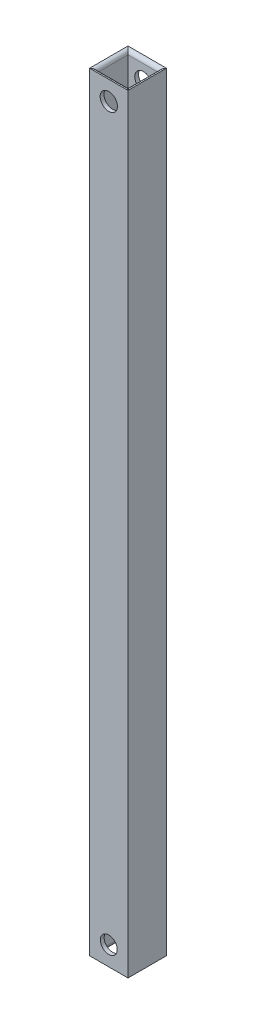
ISO-10303-21;
HEADER;
FILE_DESCRIPTION(('STEP AP214'),'2;1');
FILE_NAME('part.step','',(''),(''),'','','');
FILE_SCHEMA(('AUTOMOTIVE_DESIGN { 1 0 10303 214 1 1 1 1 }'));
ENDSEC;
DATA;
#1=APPLICATION_CONTEXT('core data for automotive mechanical design processes');
#2=APPLICATION_PROTOCOL_DEFINITION('international standard','automotive_design',2000,#1);
#3=PRODUCT_CONTEXT('',#1,'mechanical');
#4=PRODUCT('Part','Part','',(#3));
#5=PRODUCT_RELATED_PRODUCT_CATEGORY('part','',(#4));
#6=PRODUCT_DEFINITION_FORMATION('','',#4);
#7=PRODUCT_DEFINITION_CONTEXT('part definition',#1,'design');
#8=PRODUCT_DEFINITION('design','',#6,#7);
#9=PRODUCT_DEFINITION_SHAPE('','',#8);
#10=(LENGTH_UNIT() NAMED_UNIT(*) SI_UNIT(.MILLI.,.METRE.));
#11=(NAMED_UNIT(*) PLANE_ANGLE_UNIT() SI_UNIT($,.RADIAN.));
#12=(NAMED_UNIT(*) SI_UNIT($,.STERADIAN.) SOLID_ANGLE_UNIT());
#13=UNCERTAINTY_MEASURE_WITH_UNIT(LENGTH_MEASURE(1.E-05),#10,'distance_accuracy_value','');
#14=(GEOMETRIC_REPRESENTATION_CONTEXT(3) GLOBAL_UNCERTAINTY_ASSIGNED_CONTEXT((#13)) GLOBAL_UNIT_ASSIGNED_CONTEXT((#10,
#11,#12)) REPRESENTATION_CONTEXT('',''));
#15=CARTESIAN_POINT('',(0.,0.,0.));
#16=DIRECTION('',(0.,0.,1.));
#17=DIRECTION('',(1.,0.,0.));
#18=AXIS2_PLACEMENT_3D('',#15,#16,#17);
#19=CARTESIAN_POINT('',(5.,200.,-5.));
#20=DIRECTION('',(-1.,0.,0.));
#21=DIRECTION('',(0.,0.,1.));
#22=AXIS2_PLACEMENT_3D('',#19,#20,#21);
#23=PLANE('',#22);
#24=DIRECTION('',(0.,0.,-1.));
#25=VECTOR('',#24,1.);
#26=CARTESIAN_POINT('',(5.,0.,-5.));
#27=LINE('',#26,#25);
#28=CARTESIAN_POINT('',(5.,0.,5.));
#29=VERTEX_POINT('',#28);
#30=CARTESIAN_POINT('',(5.,0.,-5.));
#31=VERTEX_POINT('',#30);
#32=EDGE_CURVE('E141',#29,#31,#27,.T.);
#33=ORIENTED_EDGE('',*,*,#32,.T.);
#34=DIRECTION('',(0.,-1.,0.));
#35=VECTOR('',#34,1.);
#36=CARTESIAN_POINT('',(5.,200.,-5.));
#37=LINE('',#36,#35);
#38=CARTESIAN_POINT('',(5.,200.,-5.));
#39=VERTEX_POINT('',#38);
#40=EDGE_CURVE('E126',#39,#31,#37,.T.);
#41=ORIENTED_EDGE('',*,*,#40,.F.);
#42=DIRECTION('',(0.,0.,-1.));
#43=VECTOR('',#42,1.);
#44=CARTESIAN_POINT('',(5.,200.,-5.));
#45=LINE('',#44,#43);
#46=CARTESIAN_POINT('',(5.,200.,5.));
#47=VERTEX_POINT('',#46);
#48=EDGE_CURVE('E135',#47,#39,#45,.T.);
#49=ORIENTED_EDGE('',*,*,#48,.F.);
#50=DIRECTION('',(0.,-1.,0.));
#51=VECTOR('',#50,1.);
#52=CARTESIAN_POINT('',(5.,200.,5.));
#53=LINE('',#52,#51);
#54=EDGE_CURVE('E225',#47,#29,#53,.T.);
#55=ORIENTED_EDGE('',*,*,#54,.T.);
#56=EDGE_LOOP('',(#33,#41,#49,#55));
#57=FACE_BOUND('',#56,.T.);
#58=ADVANCED_FACE('F54',(#57),#23,.F.);
#59=CARTESIAN_POINT('',(-5.,200.,-5.));
#60=DIRECTION('',(0.,0.,1.));
#61=DIRECTION('',(1.,0.,0.));
#62=AXIS2_PLACEMENT_3D('',#59,#60,#61);
#63=PLANE('',#62);
#64=CARTESIAN_POINT('',(0.,5.,-5.));
#65=DIRECTION('',(0.,0.,1.));
#66=DIRECTION('',(1.,0.,0.));
#67=AXIS2_PLACEMENT_3D('',#64,#65,#66);
#68=CIRCLE('',#67,2.2);
#69=CARTESIAN_POINT('',(2.2,5.,-5.));
#70=VERTEX_POINT('',#69);
#71=EDGE_CURVE('E179',#70,#70,#68,.T.);
#72=ORIENTED_EDGE('',*,*,#71,.T.);
#73=EDGE_LOOP('',(#72));
#74=FACE_BOUND('',#73,.T.);
#75=CARTESIAN_POINT('',(0.,195.,-5.));
#76=DIRECTION('',(0.,0.,1.));
#77=DIRECTION('',(1.,0.,0.));
#78=AXIS2_PLACEMENT_3D('',#75,#76,#77);
#79=CIRCLE('',#78,2.25);
#80=CARTESIAN_POINT('',(2.25,195.,-5.));
#81=VERTEX_POINT('',#80);
#82=EDGE_CURVE('E201',#81,#81,#79,.T.);
#83=ORIENTED_EDGE('',*,*,#82,.T.);
#84=EDGE_LOOP('',(#83));
#85=FACE_BOUND('',#84,.T.);
#86=DIRECTION('',(-1.,0.,0.));
#87=VECTOR('',#86,1.);
#88=CARTESIAN_POINT('',(-5.,0.,-5.));
#89=LINE('',#88,#87);
#90=CARTESIAN_POINT('',(-5.,0.,-5.));
#91=VERTEX_POINT('',#90);
#92=EDGE_CURVE('E228',#31,#91,#89,.T.);
#93=ORIENTED_EDGE('',*,*,#92,.T.);
#94=DIRECTION('',(0.,-1.,0.));
#95=VECTOR('',#94,1.);
#96=CARTESIAN_POINT('',(-5.,200.,-5.));
#97=LINE('',#96,#95);
#98=CARTESIAN_POINT('',(-5.,200.,-5.));
#99=VERTEX_POINT('',#98);
#100=EDGE_CURVE('E129',#99,#91,#97,.T.);
#101=ORIENTED_EDGE('',*,*,#100,.F.);
#102=DIRECTION('',(-1.,0.,0.));
#103=VECTOR('',#102,1.);
#104=CARTESIAN_POINT('',(-5.,200.,-5.));
#105=LINE('',#104,#103);
#106=EDGE_CURVE('E123',#39,#99,#105,.T.);
#107=ORIENTED_EDGE('',*,*,#106,.F.);
#108=ORIENTED_EDGE('',*,*,#40,.T.);
#109=EDGE_LOOP('',(#93,#101,#107,#108));
#110=FACE_BOUND('',#109,.T.);
#111=ADVANCED_FACE('F125',(#74,#85,#110),#63,.F.);
#112=CARTESIAN_POINT('',(-5.,200.,-5.));
#113=DIRECTION('',(1.,0.,0.));
#114=DIRECTION('',(0.,0.,-1.));
#115=AXIS2_PLACEMENT_3D('',#112,#113,#114);
#116=PLANE('',#115);
#117=DIRECTION('',(0.,0.,1.));
#118=VECTOR('',#117,1.);
#119=CARTESIAN_POINT('',(-5.,0.,-5.));
#120=LINE('',#119,#118);
#121=CARTESIAN_POINT('',(-5.,0.,5.));
#122=VERTEX_POINT('',#121);
#123=EDGE_CURVE('E231',#91,#122,#120,.T.);
#124=ORIENTED_EDGE('',*,*,#123,.T.);
#125=DIRECTION('',(0.,-1.,0.));
#126=VECTOR('',#125,1.);
#127=CARTESIAN_POINT('',(-5.,200.,5.));
#128=LINE('',#127,#126);
#129=CARTESIAN_POINT('',(-5.,200.,5.));
#130=VERTEX_POINT('',#129);
#131=EDGE_CURVE('E239',#130,#122,#128,.T.);
#132=ORIENTED_EDGE('',*,*,#131,.F.);
#133=DIRECTION('',(0.,0.,1.));
#134=VECTOR('',#133,1.);
#135=CARTESIAN_POINT('',(-5.,200.,-5.));
#136=LINE('',#135,#134);
#137=EDGE_CURVE('E134',#99,#130,#136,.T.);
#138=ORIENTED_EDGE('',*,*,#137,.F.);
#139=ORIENTED_EDGE('',*,*,#100,.T.);
#140=EDGE_LOOP('',(#124,#132,#138,#139));
#141=FACE_BOUND('',#140,.T.);
#142=ADVANCED_FACE('F308',(#141),#116,.F.);
#143=CARTESIAN_POINT('',(-5.,200.,5.));
#144=DIRECTION('',(0.,0.,-1.));
#145=DIRECTION('',(-1.,0.,0.));
#146=AXIS2_PLACEMENT_3D('',#143,#144,#145);
#147=PLANE('',#146);
#148=CARTESIAN_POINT('',(0.,5.,5.));
#149=DIRECTION('',(0.,0.,1.));
#150=DIRECTION('',(1.,0.,0.));
#151=AXIS2_PLACEMENT_3D('',#148,#149,#150);
#152=CIRCLE('',#151,2.2);
#153=CARTESIAN_POINT('',(2.2,5.,5.));
#154=VERTEX_POINT('',#153);
#155=EDGE_CURVE('E188',#154,#154,#152,.T.);
#156=ORIENTED_EDGE('',*,*,#155,.F.);
#157=EDGE_LOOP('',(#156));
#158=FACE_BOUND('',#157,.T.);
#159=CARTESIAN_POINT('',(0.,195.,5.));
#160=DIRECTION('',(0.,0.,1.));
#161=DIRECTION('',(1.,0.,0.));
#162=AXIS2_PLACEMENT_3D('',#159,#160,#161);
#163=CIRCLE('',#162,2.25);
#164=CARTESIAN_POINT('',(2.25,195.,5.));
#165=VERTEX_POINT('',#164);
#166=EDGE_CURVE('E195',#165,#165,#163,.T.);
#167=ORIENTED_EDGE('',*,*,#166,.F.);
#168=EDGE_LOOP('',(#167));
#169=FACE_BOUND('',#168,.T.);
#170=DIRECTION('',(1.,0.,0.));
#171=VECTOR('',#170,1.);
#172=CARTESIAN_POINT('',(-5.,0.,5.));
#173=LINE('',#172,#171);
#174=EDGE_CURVE('E151',#122,#29,#173,.T.);
#175=ORIENTED_EDGE('',*,*,#174,.T.);
#176=ORIENTED_EDGE('',*,*,#54,.F.);
#177=DIRECTION('',(1.,0.,0.));
#178=VECTOR('',#177,1.);
#179=CARTESIAN_POINT('',(-5.,200.,5.));
#180=LINE('',#179,#178);
#181=EDGE_CURVE('E222',#130,#47,#180,.T.);
#182=ORIENTED_EDGE('',*,*,#181,.F.);
#183=ORIENTED_EDGE('',*,*,#131,.T.);
#184=EDGE_LOOP('',(#175,#176,#182,#183));
#185=FACE_BOUND('',#184,.T.);
#186=ADVANCED_FACE('F311',(#158,#169,#185),#147,.F.);
#187=CARTESIAN_POINT('',(4.,200.,-4.));
#188=DIRECTION('',(-1.,0.,0.));
#189=DIRECTION('',(0.,0.,1.));
#190=AXIS2_PLACEMENT_3D('',#187,#188,#189);
#191=PLANE('',#190);
#192=DIRECTION('',(0.,-1.,0.));
#193=VECTOR('',#192,1.);
#194=CARTESIAN_POINT('',(4.,200.,-4.));
#195=LINE('',#194,#193);
#196=CARTESIAN_POINT('',(4.,199.,-4.));
#197=VERTEX_POINT('',#196);
#198=CARTESIAN_POINT('',(4.,1.,-4.));
#199=VERTEX_POINT('',#198);
#200=EDGE_CURVE('E216',#197,#199,#195,.T.);
#201=ORIENTED_EDGE('',*,*,#200,.T.);
#202=DIRECTION('',(0.,0.,-1.));
#203=VECTOR('',#202,1.);
#204=CARTESIAN_POINT('',(4.,1.,4.));
#205=LINE('',#204,#203);
#206=CARTESIAN_POINT('',(4.,1.,4.));
#207=VERTEX_POINT('',#206);
#208=EDGE_CURVE('E260',#199,#207,#205,.F.);
#209=ORIENTED_EDGE('',*,*,#208,.T.);
#210=DIRECTION('',(0.,-1.,0.));
#211=VECTOR('',#210,1.);
#212=CARTESIAN_POINT('',(4.,200.,4.));
#213=LINE('',#212,#211);
#214=CARTESIAN_POINT('',(4.,199.,4.));
#215=VERTEX_POINT('',#214);
#216=EDGE_CURVE('E205',#215,#207,#213,.T.);
#217=ORIENTED_EDGE('',*,*,#216,.F.);
#218=DIRECTION('',(0.,0.,-1.));
#219=VECTOR('',#218,1.);
#220=CARTESIAN_POINT('',(4.,199.,-4.));
#221=LINE('',#220,#219);
#222=EDGE_CURVE('E257',#215,#197,#221,.T.);
#223=ORIENTED_EDGE('',*,*,#222,.T.);
#224=EDGE_LOOP('',(#201,#209,#217,#223));
#225=FACE_BOUND('',#224,.T.);
#226=ADVANCED_FACE('F289',(#225),#191,.T.);
#227=CARTESIAN_POINT('',(-4.,200.,-4.));
#228=DIRECTION('',(0.,0.,1.));
#229=DIRECTION('',(1.,0.,0.));
#230=AXIS2_PLACEMENT_3D('',#227,#228,#229);
#231=PLANE('',#230);
#232=CARTESIAN_POINT('',(0.,5.,-4.));
#233=DIRECTION('',(0.,0.,1.));
#234=DIRECTION('',(1.,0.,0.));
#235=AXIS2_PLACEMENT_3D('',#232,#233,#234);
#236=CIRCLE('',#235,2.2);
#237=CARTESIAN_POINT('',(2.2,5.,-4.));
#238=VERTEX_POINT('',#237);
#239=EDGE_CURVE('E156',#238,#238,#236,.T.);
#240=ORIENTED_EDGE('',*,*,#239,.F.);
#241=EDGE_LOOP('',(#240));
#242=FACE_BOUND('',#241,.T.);
#243=CARTESIAN_POINT('',(0.,195.,-4.));
#244=DIRECTION('',(0.,0.,1.));
#245=DIRECTION('',(1.,0.,0.));
#246=AXIS2_PLACEMENT_3D('',#243,#244,#245);
#247=CIRCLE('',#246,2.25);
#248=CARTESIAN_POINT('',(2.25,195.,-4.));
#249=VERTEX_POINT('',#248);
#250=EDGE_CURVE('E178',#249,#249,#247,.T.);
#251=ORIENTED_EDGE('',*,*,#250,.F.);
#252=EDGE_LOOP('',(#251));
#253=FACE_BOUND('',#252,.T.);
#254=DIRECTION('',(0.,-1.,0.));
#255=VECTOR('',#254,1.);
#256=CARTESIAN_POINT('',(-4.,200.,-4.));
#257=LINE('',#256,#255);
#258=CARTESIAN_POINT('',(-4.,199.,-4.));
#259=VERTEX_POINT('',#258);
#260=CARTESIAN_POINT('',(-4.,1.,-4.));
#261=VERTEX_POINT('',#260);
#262=EDGE_CURVE('E213',#259,#261,#257,.T.);
#263=ORIENTED_EDGE('',*,*,#262,.T.);
#264=DIRECTION('',(-1.,0.,0.));
#265=VECTOR('',#264,1.);
#266=CARTESIAN_POINT('',(4.,1.,-4.));
#267=LINE('',#266,#265);
#268=EDGE_CURVE('E13',#261,#199,#267,.F.);
#269=ORIENTED_EDGE('',*,*,#268,.T.);
#270=ORIENTED_EDGE('',*,*,#200,.F.);
#271=DIRECTION('',(-1.,0.,0.));
#272=VECTOR('',#271,1.);
#273=CARTESIAN_POINT('',(-4.,199.,-4.));
#274=LINE('',#273,#272);
#275=EDGE_CURVE('E64',#197,#259,#274,.T.);
#276=ORIENTED_EDGE('',*,*,#275,.T.);
#277=EDGE_LOOP('',(#263,#269,#270,#276));
#278=FACE_BOUND('',#277,.T.);
#279=ADVANCED_FACE('F299',(#242,#253,#278),#231,.T.);
#280=CARTESIAN_POINT('',(-4.,200.,-4.));
#281=DIRECTION('',(1.,0.,0.));
#282=DIRECTION('',(0.,0.,-1.));
#283=AXIS2_PLACEMENT_3D('',#280,#281,#282);
#284=PLANE('',#283);
#285=DIRECTION('',(0.,-1.,0.));
#286=VECTOR('',#285,1.);
#287=CARTESIAN_POINT('',(-4.,200.,4.));
#288=LINE('',#287,#286);
#289=CARTESIAN_POINT('',(-4.,199.,4.));
#290=VERTEX_POINT('',#289);
#291=CARTESIAN_POINT('',(-4.,1.,4.));
#292=VERTEX_POINT('',#291);
#293=EDGE_CURVE('E209',#290,#292,#288,.T.);
#294=ORIENTED_EDGE('',*,*,#293,.T.);
#295=DIRECTION('',(0.,0.,1.));
#296=VECTOR('',#295,1.);
#297=CARTESIAN_POINT('',(-4.,1.,-4.));
#298=LINE('',#297,#296);
#299=EDGE_CURVE('E247',#292,#261,#298,.F.);
#300=ORIENTED_EDGE('',*,*,#299,.T.);
#301=ORIENTED_EDGE('',*,*,#262,.F.);
#302=DIRECTION('',(0.,0.,1.));
#303=VECTOR('',#302,1.);
#304=CARTESIAN_POINT('',(-4.,199.,-4.));
#305=LINE('',#304,#303);
#306=EDGE_CURVE('E144',#259,#290,#305,.T.);
#307=ORIENTED_EDGE('',*,*,#306,.T.);
#308=EDGE_LOOP('',(#294,#300,#301,#307));
#309=FACE_BOUND('',#308,.T.);
#310=ADVANCED_FACE('F303',(#309),#284,.T.);
#311=CARTESIAN_POINT('',(-4.,200.,4.));
#312=DIRECTION('',(0.,0.,-1.));
#313=DIRECTION('',(-1.,0.,0.));
#314=AXIS2_PLACEMENT_3D('',#311,#312,#313);
#315=PLANE('',#314);
#316=CARTESIAN_POINT('',(0.,5.,4.));
#317=DIRECTION('',(0.,0.,-1.));
#318=DIRECTION('',(-1.,0.,0.));
#319=AXIS2_PLACEMENT_3D('',#316,#317,#318);
#320=CIRCLE('',#319,2.2);
#321=CARTESIAN_POINT('',(-2.2,5.,4.));
#322=VERTEX_POINT('',#321);
#323=EDGE_CURVE('E58',#322,#322,#320,.T.);
#324=ORIENTED_EDGE('',*,*,#323,.F.);
#325=EDGE_LOOP('',(#324));
#326=FACE_BOUND('',#325,.T.);
#327=CARTESIAN_POINT('',(0.,195.,4.));
#328=DIRECTION('',(0.,0.,-1.));
#329=DIRECTION('',(-1.,0.,0.));
#330=AXIS2_PLACEMENT_3D('',#327,#328,#329);
#331=CIRCLE('',#330,2.25);
#332=CARTESIAN_POINT('',(-2.25,195.,4.));
#333=VERTEX_POINT('',#332);
#334=EDGE_CURVE('E175',#333,#333,#331,.T.);
#335=ORIENTED_EDGE('',*,*,#334,.F.);
#336=EDGE_LOOP('',(#335));
#337=FACE_BOUND('',#336,.T.);
#338=ORIENTED_EDGE('',*,*,#216,.T.);
#339=DIRECTION('',(1.,0.,0.));
#340=VECTOR('',#339,1.);
#341=CARTESIAN_POINT('',(-4.,1.,4.));
#342=LINE('',#341,#340);
#343=EDGE_CURVE('E254',#207,#292,#342,.F.);
#344=ORIENTED_EDGE('',*,*,#343,.T.);
#345=ORIENTED_EDGE('',*,*,#293,.F.);
#346=DIRECTION('',(1.,0.,0.));
#347=VECTOR('',#346,1.);
#348=CARTESIAN_POINT('',(-4.,199.,4.));
#349=LINE('',#348,#347);
#350=EDGE_CURVE('E251',#290,#215,#349,.T.);
#351=ORIENTED_EDGE('',*,*,#350,.T.);
#352=EDGE_LOOP('',(#338,#344,#345,#351));
#353=FACE_BOUND('',#352,.T.);
#354=ADVANCED_FACE('F291',(#326,#337,#353),#315,.T.);
#355=CARTESIAN_POINT('',(5.,1.,0.));
#356=DIRECTION('',(0.,0.,1.));
#357=DIRECTION('',(1.,0.,0.));
#358=AXIS2_PLACEMENT_3D('',#355,#356,#357);
#359=CYLINDRICAL_SURFACE('',#358,1.);
#360=CARTESIAN_POINT('',(5.,1.,5.));
#361=DIRECTION('',(-0.707106781186547,0.,0.707106781186548));
#362=DIRECTION('',(-0.707106781186547,0.,-0.707106781186547));
#363=AXIS2_PLACEMENT_3D('',#360,#361,#362);
#364=ELLIPSE('',#363,1.4142135623731,1.);
#365=EDGE_CURVE('E269',#207,#29,#364,.T.);
#366=ORIENTED_EDGE('',*,*,#365,.F.);
#367=ORIENTED_EDGE('',*,*,#208,.F.);
#368=CARTESIAN_POINT('',(5.,1.,-5.));
#369=DIRECTION('',(0.707106781186547,0.,0.707106781186547));
#370=DIRECTION('',(-0.707106781186547,0.,0.707106781186548));
#371=AXIS2_PLACEMENT_3D('',#368,#369,#370);
#372=ELLIPSE('',#371,1.41421356237309,1.);
#373=EDGE_CURVE('E166',#31,#199,#372,.F.);
#374=ORIENTED_EDGE('',*,*,#373,.F.);
#375=ORIENTED_EDGE('',*,*,#32,.F.);
#376=EDGE_LOOP('',(#366,#367,#374,#375));
#377=FACE_BOUND('',#376,.T.);
#378=ADVANCED_FACE('F286',(#377),#359,.T.);
#379=CARTESIAN_POINT('',(0.,1.,-5.));
#380=DIRECTION('',(1.,0.,0.));
#381=DIRECTION('',(0.,0.,-1.));
#382=AXIS2_PLACEMENT_3D('',#379,#380,#381);
#383=CYLINDRICAL_SURFACE('',#382,1.);
#384=ORIENTED_EDGE('',*,*,#373,.T.);
#385=ORIENTED_EDGE('',*,*,#268,.F.);
#386=CARTESIAN_POINT('',(-5.,1.,-5.));
#387=DIRECTION('',(0.707106781186547,0.,-0.707106781186547));
#388=DIRECTION('',(-0.707106781186547,0.,-0.707106781186547));
#389=AXIS2_PLACEMENT_3D('',#386,#387,#388);
#390=ELLIPSE('',#389,1.41421356237309,1.);
#391=EDGE_CURVE('E267',#91,#261,#390,.F.);
#392=ORIENTED_EDGE('',*,*,#391,.F.);
#393=ORIENTED_EDGE('',*,*,#92,.F.);
#394=EDGE_LOOP('',(#384,#385,#392,#393));
#395=FACE_BOUND('',#394,.T.);
#396=ADVANCED_FACE('F282',(#395),#383,.T.);
#397=CARTESIAN_POINT('',(0.,1.,5.));
#398=DIRECTION('',(-1.,0.,0.));
#399=DIRECTION('',(0.,0.,1.));
#400=AXIS2_PLACEMENT_3D('',#397,#398,#399);
#401=CYLINDRICAL_SURFACE('',#400,1.);
#402=ORIENTED_EDGE('',*,*,#365,.T.);
#403=ORIENTED_EDGE('',*,*,#174,.F.);
#404=CARTESIAN_POINT('',(-5.,1.,5.));
#405=DIRECTION('',(-0.707106781186547,0.,-0.707106781186547));
#406=DIRECTION('',(0.707106781186547,0.,-0.707106781186547));
#407=AXIS2_PLACEMENT_3D('',#404,#405,#406);
#408=ELLIPSE('',#407,1.41421356237309,1.);
#409=EDGE_CURVE('E174',#292,#122,#408,.T.);
#410=ORIENTED_EDGE('',*,*,#409,.F.);
#411=ORIENTED_EDGE('',*,*,#343,.F.);
#412=EDGE_LOOP('',(#402,#403,#410,#411));
#413=FACE_BOUND('',#412,.T.);
#414=ADVANCED_FACE('F313',(#413),#401,.T.);
#415=CARTESIAN_POINT('',(-5.,1.,0.));
#416=DIRECTION('',(0.,0.,-1.));
#417=DIRECTION('',(-1.,0.,0.));
#418=AXIS2_PLACEMENT_3D('',#415,#416,#417);
#419=CYLINDRICAL_SURFACE('',#418,1.);
#420=ORIENTED_EDGE('',*,*,#391,.T.);
#421=ORIENTED_EDGE('',*,*,#299,.F.);
#422=ORIENTED_EDGE('',*,*,#409,.T.);
#423=ORIENTED_EDGE('',*,*,#123,.F.);
#424=EDGE_LOOP('',(#420,#421,#422,#423));
#425=FACE_BOUND('',#424,.T.);
#426=ADVANCED_FACE('F315',(#425),#419,.T.);
#427=CARTESIAN_POINT('',(-5.,199.,-4.));
#428=DIRECTION('',(0.,0.,1.));
#429=DIRECTION('',(1.,0.,0.));
#430=AXIS2_PLACEMENT_3D('',#427,#428,#429);
#431=CYLINDRICAL_SURFACE('',#430,1.);
#432=CARTESIAN_POINT('',(-5.,199.,-5.));
#433=DIRECTION('',(-0.707106781186547,0.,0.707106781186547));
#434=DIRECTION('',(-0.707106781186547,0.,-0.707106781186547));
#435=AXIS2_PLACEMENT_3D('',#432,#433,#434);
#436=ELLIPSE('',#435,1.41421356237309,1.);
#437=EDGE_CURVE('E161',#99,#259,#436,.F.);
#438=ORIENTED_EDGE('',*,*,#437,.F.);
#439=ORIENTED_EDGE('',*,*,#137,.T.);
#440=CARTESIAN_POINT('',(-5.,199.,5.));
#441=DIRECTION('',(0.707106781186547,0.,0.707106781186547));
#442=DIRECTION('',(-0.707106781186547,0.,0.707106781186547));
#443=AXIS2_PLACEMENT_3D('',#440,#441,#442);
#444=ELLIPSE('',#443,1.41421356237309,1.);
#445=EDGE_CURVE('E171',#290,#130,#444,.T.);
#446=ORIENTED_EDGE('',*,*,#445,.F.);
#447=ORIENTED_EDGE('',*,*,#306,.F.);
#448=EDGE_LOOP('',(#438,#439,#446,#447));
#449=FACE_BOUND('',#448,.T.);
#450=ADVANCED_FACE('F56',(#449),#431,.T.);
#451=CARTESIAN_POINT('',(-4.,199.,5.));
#452=DIRECTION('',(1.,0.,0.));
#453=DIRECTION('',(0.,0.,-1.));
#454=AXIS2_PLACEMENT_3D('',#451,#452,#453);
#455=CYLINDRICAL_SURFACE('',#454,1.);
#456=ORIENTED_EDGE('',*,*,#445,.T.);
#457=ORIENTED_EDGE('',*,*,#181,.T.);
#458=CARTESIAN_POINT('',(5.,199.,5.));
#459=DIRECTION('',(0.707106781186547,0.,-0.707106781186548));
#460=DIRECTION('',(-0.707106781186547,0.,-0.707106781186547));
#461=AXIS2_PLACEMENT_3D('',#458,#459,#460);
#462=ELLIPSE('',#461,1.4142135623731,1.);
#463=EDGE_CURVE('E148',#215,#47,#462,.T.);
#464=ORIENTED_EDGE('',*,*,#463,.F.);
#465=ORIENTED_EDGE('',*,*,#350,.F.);
#466=EDGE_LOOP('',(#456,#457,#464,#465));
#467=FACE_BOUND('',#466,.T.);
#468=ADVANCED_FACE('F296',(#467),#455,.T.);
#469=CARTESIAN_POINT('',(-4.,199.,-5.));
#470=DIRECTION('',(-1.,0.,0.));
#471=DIRECTION('',(0.,0.,1.));
#472=AXIS2_PLACEMENT_3D('',#469,#470,#471);
#473=CYLINDRICAL_SURFACE('',#472,1.);
#474=ORIENTED_EDGE('',*,*,#437,.T.);
#475=ORIENTED_EDGE('',*,*,#275,.F.);
#476=CARTESIAN_POINT('',(5.,199.,-5.));
#477=DIRECTION('',(-0.707106781186547,0.,-0.707106781186547));
#478=DIRECTION('',(0.707106781186547,0.,-0.707106781186548));
#479=AXIS2_PLACEMENT_3D('',#476,#477,#478);
#480=ELLIPSE('',#479,1.41421356237309,1.);
#481=EDGE_CURVE('E78',#39,#197,#480,.F.);
#482=ORIENTED_EDGE('',*,*,#481,.F.);
#483=ORIENTED_EDGE('',*,*,#106,.T.);
#484=EDGE_LOOP('',(#474,#475,#482,#483));
#485=FACE_BOUND('',#484,.T.);
#486=ADVANCED_FACE('F153',(#485),#473,.T.);
#487=CARTESIAN_POINT('',(5.,199.,-4.));
#488=DIRECTION('',(0.,0.,-1.));
#489=DIRECTION('',(-1.,0.,0.));
#490=AXIS2_PLACEMENT_3D('',#487,#488,#489);
#491=CYLINDRICAL_SURFACE('',#490,1.);
#492=ORIENTED_EDGE('',*,*,#463,.T.);
#493=ORIENTED_EDGE('',*,*,#48,.T.);
#494=ORIENTED_EDGE('',*,*,#481,.T.);
#495=ORIENTED_EDGE('',*,*,#222,.F.);
#496=EDGE_LOOP('',(#492,#493,#494,#495));
#497=FACE_BOUND('',#496,.T.);
#498=ADVANCED_FACE('F146',(#497),#491,.T.);
#499=CARTESIAN_POINT('',(0.,195.,-5.));
#500=DIRECTION('',(0.,0.,1.));
#501=DIRECTION('',(1.,0.,0.));
#502=AXIS2_PLACEMENT_3D('',#499,#500,#501);
#503=CYLINDRICAL_SURFACE('',#502,2.25);
#504=ORIENTED_EDGE('',*,*,#334,.T.);
#505=EDGE_LOOP('',(#504));
#506=FACE_BOUND('',#505,.T.);
#507=ORIENTED_EDGE('',*,*,#166,.T.);
#508=EDGE_LOOP('',(#507));
#509=FACE_BOUND('',#508,.T.);
#510=ADVANCED_FACE('F345',(#506,#509),#503,.F.);
#511=CARTESIAN_POINT('',(0.,5.,-5.));
#512=DIRECTION('',(0.,0.,1.));
#513=DIRECTION('',(1.,0.,0.));
#514=AXIS2_PLACEMENT_3D('',#511,#512,#513);
#515=CYLINDRICAL_SURFACE('',#514,2.2);
#516=ORIENTED_EDGE('',*,*,#323,.T.);
#517=EDGE_LOOP('',(#516));
#518=FACE_BOUND('',#517,.T.);
#519=ORIENTED_EDGE('',*,*,#155,.T.);
#520=EDGE_LOOP('',(#519));
#521=FACE_BOUND('',#520,.T.);
#522=ADVANCED_FACE('F348',(#518,#521),#515,.F.);
#523=ORIENTED_EDGE('',*,*,#250,.T.);
#524=EDGE_LOOP('',(#523));
#525=FACE_BOUND('',#524,.T.);
#526=ORIENTED_EDGE('',*,*,#82,.F.);
#527=EDGE_LOOP('',(#526));
#528=FACE_BOUND('',#527,.T.);
#529=ADVANCED_FACE('F349',(#525,#528),#503,.F.);
#530=ORIENTED_EDGE('',*,*,#239,.T.);
#531=EDGE_LOOP('',(#530));
#532=FACE_BOUND('',#531,.T.);
#533=ORIENTED_EDGE('',*,*,#71,.F.);
#534=EDGE_LOOP('',(#533));
#535=FACE_BOUND('',#534,.T.);
#536=ADVANCED_FACE('F352',(#532,#535),#515,.F.);
#537=CLOSED_SHELL('',(#58,#111,#142,#186,#226,#279,#310,#354,#378,#396,#414,#426,#450,#468,#486,
#498,#510,#522,#529,#536));
#538=MANIFOLD_SOLID_BREP('B2',#537);
#539=ADVANCED_BREP_SHAPE_REPRESENTATION('',(#18,#538),#14);
#540=SHAPE_DEFINITION_REPRESENTATION(#9,#539);
ENDSEC;
END-ISO-10303-21;
